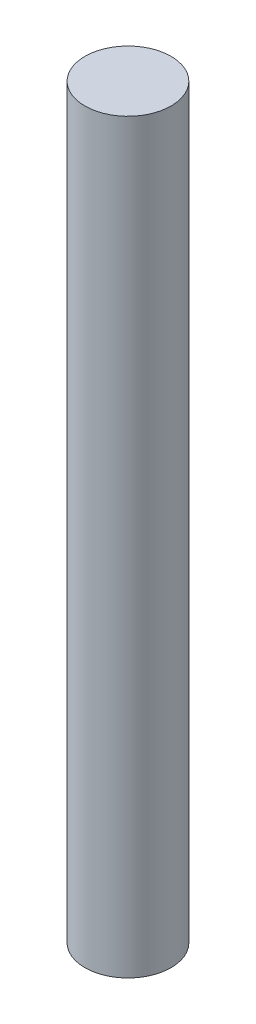
ISO-10303-21;
HEADER;
FILE_DESCRIPTION(('STEP AP214'),'2;1');
FILE_NAME('part.step','',(''),(''),'','','');
FILE_SCHEMA(('AUTOMOTIVE_DESIGN { 1 0 10303 214 1 1 1 1 }'));
ENDSEC;
DATA;
#1=APPLICATION_CONTEXT('core data for automotive mechanical design processes');
#2=APPLICATION_PROTOCOL_DEFINITION('international standard','automotive_design',2000,#1);
#3=PRODUCT_CONTEXT('',#1,'mechanical');
#4=PRODUCT('Part','Part','',(#3));
#5=PRODUCT_RELATED_PRODUCT_CATEGORY('part','',(#4));
#6=PRODUCT_DEFINITION_FORMATION('','',#4);
#7=PRODUCT_DEFINITION_CONTEXT('part definition',#1,'design');
#8=PRODUCT_DEFINITION('design','',#6,#7);
#9=PRODUCT_DEFINITION_SHAPE('','',#8);
#10=(LENGTH_UNIT() NAMED_UNIT(*) SI_UNIT(.MILLI.,.METRE.));
#11=(NAMED_UNIT(*) PLANE_ANGLE_UNIT() SI_UNIT($,.RADIAN.));
#12=(NAMED_UNIT(*) SI_UNIT($,.STERADIAN.) SOLID_ANGLE_UNIT());
#13=UNCERTAINTY_MEASURE_WITH_UNIT(LENGTH_MEASURE(1.E-05),#10,'distance_accuracy_value','');
#14=(GEOMETRIC_REPRESENTATION_CONTEXT(3) GLOBAL_UNCERTAINTY_ASSIGNED_CONTEXT((#13)) GLOBAL_UNIT_ASSIGNED_CONTEXT((#10,
#11,#12)) REPRESENTATION_CONTEXT('',''));
#15=CARTESIAN_POINT('',(0.,0.,0.));
#16=DIRECTION('',(0.,0.,1.));
#17=DIRECTION('',(1.,0.,0.));
#18=AXIS2_PLACEMENT_3D('',#15,#16,#17);
#19=CARTESIAN_POINT('',(0.,33.02,0.));
#20=DIRECTION('',(0.,-1.,0.));
#21=DIRECTION('',(0.,0.,-1.));
#22=AXIS2_PLACEMENT_3D('',#19,#20,#21);
#23=CYLINDRICAL_SURFACE('',#22,1.905);
#24=CARTESIAN_POINT('',(0.,33.02,0.));
#25=DIRECTION('',(0.,1.,0.));
#26=DIRECTION('',(0.,0.,1.));
#27=AXIS2_PLACEMENT_3D('',#24,#25,#26);
#28=CIRCLE('',#27,1.905);
#29=CARTESIAN_POINT('',(0.,33.02,1.905));
#30=VERTEX_POINT('',#29);
#31=EDGE_CURVE('E10',#30,#30,#28,.T.);
#32=ORIENTED_EDGE('',*,*,#31,.F.);
#33=EDGE_LOOP('',(#32));
#34=FACE_BOUND('',#33,.T.);
#35=CARTESIAN_POINT('',(0.,0.,0.));
#36=DIRECTION('',(0.,1.,0.));
#37=DIRECTION('',(0.,0.,1.));
#38=AXIS2_PLACEMENT_3D('',#35,#36,#37);
#39=CIRCLE('',#38,1.905);
#40=CARTESIAN_POINT('',(0.,0.,1.905));
#41=VERTEX_POINT('',#40);
#42=EDGE_CURVE('E40',#41,#41,#39,.T.);
#43=ORIENTED_EDGE('',*,*,#42,.T.);
#44=EDGE_LOOP('',(#43));
#45=FACE_BOUND('',#44,.T.);
#46=ADVANCED_FACE('F37',(#34,#45),#23,.T.);
#47=CARTESIAN_POINT('',(0.,33.02,0.));
#48=DIRECTION('',(0.,1.,0.));
#49=DIRECTION('',(0.,0.,1.));
#50=AXIS2_PLACEMENT_3D('',#47,#48,#49);
#51=PLANE('',#50);
#52=ORIENTED_EDGE('',*,*,#31,.T.);
#53=EDGE_LOOP('',(#52));
#54=FACE_BOUND('',#53,.T.);
#55=ADVANCED_FACE('F54',(#54),#51,.T.);
#56=CARTESIAN_POINT('',(0.,0.,0.));
#57=DIRECTION('',(0.,1.,0.));
#58=DIRECTION('',(0.,0.,1.));
#59=AXIS2_PLACEMENT_3D('',#56,#57,#58);
#60=PLANE('',#59);
#61=ORIENTED_EDGE('',*,*,#42,.F.);
#62=EDGE_LOOP('',(#61));
#63=FACE_BOUND('',#62,.T.);
#64=ADVANCED_FACE('F52',(#63),#60,.F.);
#65=CLOSED_SHELL('',(#46,#55,#64));
#66=MANIFOLD_SOLID_BREP('B2',#65);
#67=ADVANCED_BREP_SHAPE_REPRESENTATION('',(#18,#66),#14);
#68=SHAPE_DEFINITION_REPRESENTATION(#9,#67);
ENDSEC;
END-ISO-10303-21;
